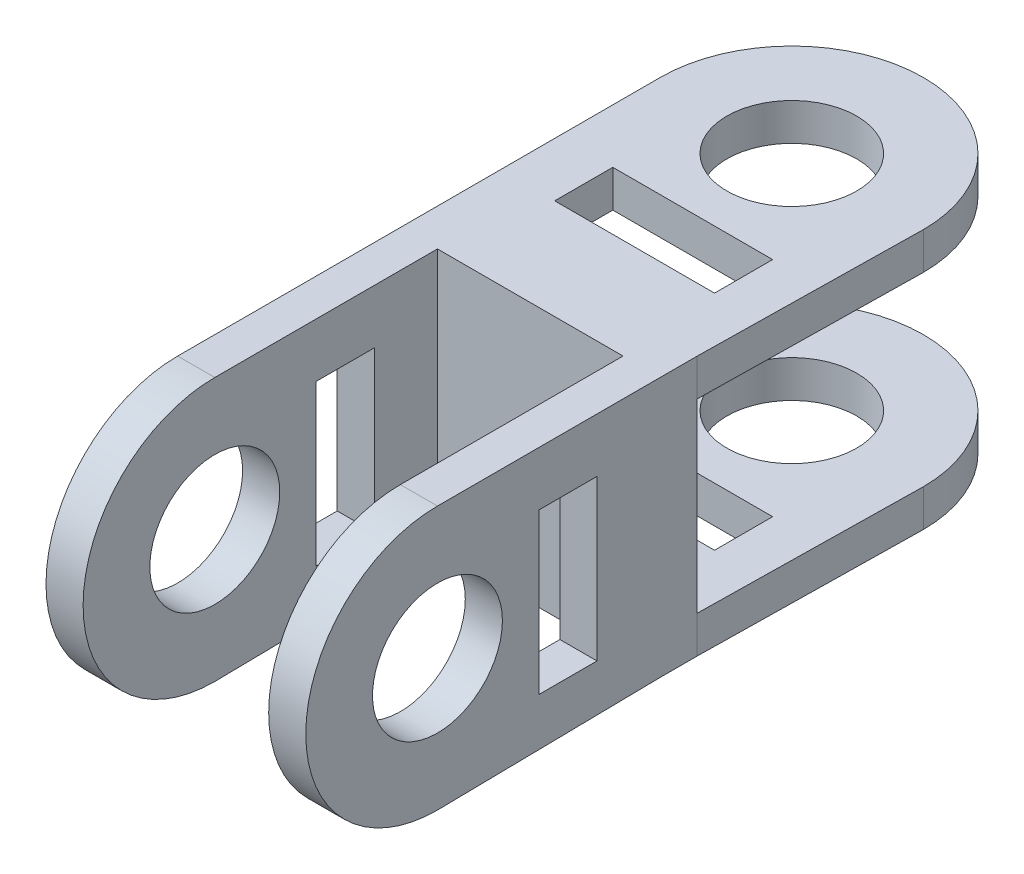
ISO-10303-21;
HEADER;
FILE_DESCRIPTION(('STEP AP214'),'2;1');
FILE_NAME('part.step','',(''),(''),'','','');
FILE_SCHEMA(('AUTOMOTIVE_DESIGN { 1 0 10303 214 1 1 1 1 }'));
ENDSEC;
DATA;
#1=APPLICATION_CONTEXT('core data for automotive mechanical design processes');
#2=APPLICATION_PROTOCOL_DEFINITION('international standard','automotive_design',2000,#1);
#3=PRODUCT_CONTEXT('',#1,'mechanical');
#4=PRODUCT('Part','Part','',(#3));
#5=PRODUCT_RELATED_PRODUCT_CATEGORY('part','',(#4));
#6=PRODUCT_DEFINITION_FORMATION('','',#4);
#7=PRODUCT_DEFINITION_CONTEXT('part definition',#1,'design');
#8=PRODUCT_DEFINITION('design','',#6,#7);
#9=PRODUCT_DEFINITION_SHAPE('','',#8);
#10=(LENGTH_UNIT() NAMED_UNIT(*) SI_UNIT(.MILLI.,.METRE.));
#11=(NAMED_UNIT(*) PLANE_ANGLE_UNIT() SI_UNIT($,.RADIAN.));
#12=(NAMED_UNIT(*) SI_UNIT($,.STERADIAN.) SOLID_ANGLE_UNIT());
#13=UNCERTAINTY_MEASURE_WITH_UNIT(LENGTH_MEASURE(1.E-05),#10,'distance_accuracy_value','');
#14=(GEOMETRIC_REPRESENTATION_CONTEXT(3) GLOBAL_UNCERTAINTY_ASSIGNED_CONTEXT((#13)) GLOBAL_UNIT_ASSIGNED_CONTEXT((#10,
#11,#12)) REPRESENTATION_CONTEXT('',''));
#15=CARTESIAN_POINT('',(0.,0.,0.));
#16=DIRECTION('',(0.,0.,1.));
#17=DIRECTION('',(1.,0.,0.));
#18=AXIS2_PLACEMENT_3D('',#15,#16,#17);
#19=CARTESIAN_POINT('',(-35.,35.,10.));
#20=DIRECTION('',(1.,0.,0.));
#21=DIRECTION('',(0.,1.,0.));
#22=AXIS2_PLACEMENT_3D('',#19,#20,#21);
#23=PLANE('',#22);
#24=DIRECTION('',(0.,-1.,0.));
#25=VECTOR('',#24,1.);
#26=CARTESIAN_POINT('',(-35.,20.4226359715063,42.6735252957079));
#27=LINE('',#26,#25);
#28=CARTESIAN_POINT('',(-35.,20.4226359715063,42.6735252957079));
#29=VERTEX_POINT('',#28);
#30=CARTESIAN_POINT('',(-35.,-22.6429275882208,42.6735252957079));
#31=VERTEX_POINT('',#30);
#32=EDGE_CURVE('E373',#29,#31,#27,.T.);
#33=ORIENTED_EDGE('',*,*,#32,.T.);
#34=DIRECTION('',(0.,0.,-1.));
#35=VECTOR('',#34,1.);
#36=CARTESIAN_POINT('',(-35.,-22.6429275882208,42.6735252957079));
#37=LINE('',#36,#35);
#38=CARTESIAN_POINT('',(-35.,-22.6429275882208,27.013320364898));
#39=VERTEX_POINT('',#38);
#40=EDGE_CURVE('E395',#31,#39,#37,.T.);
#41=ORIENTED_EDGE('',*,*,#40,.T.);
#42=DIRECTION('',(0.,1.,0.));
#43=VECTOR('',#42,1.);
#44=CARTESIAN_POINT('',(-35.,20.4226359715063,27.013320364898));
#45=LINE('',#44,#43);
#46=CARTESIAN_POINT('',(-35.,20.4226359715063,27.013320364898));
#47=VERTEX_POINT('',#46);
#48=EDGE_CURVE('E399',#39,#47,#45,.T.);
#49=ORIENTED_EDGE('',*,*,#48,.T.);
#50=DIRECTION('',(0.,0.,1.));
#51=VECTOR('',#50,1.);
#52=CARTESIAN_POINT('',(-35.,20.4226359715063,42.6735252957079));
#53=LINE('',#52,#51);
#54=EDGE_CURVE('E381',#47,#29,#53,.T.);
#55=ORIENTED_EDGE('',*,*,#54,.T.);
#56=EDGE_LOOP('',(#33,#41,#49,#55));
#57=FACE_BOUND('',#56,.T.);
#58=CARTESIAN_POINT('',(-35.,-0.47669536404981,70.));
#59=DIRECTION('',(1.,0.,0.));
#60=DIRECTION('',(0.,0.,-1.));
#61=AXIS2_PLACEMENT_3D('',#58,#59,#60);
#62=CIRCLE('',#61,17.5);
#63=CARTESIAN_POINT('',(-35.,-0.47669536404981,52.5));
#64=VERTEX_POINT('',#63);
#65=EDGE_CURVE('E425',#64,#64,#62,.T.);
#66=ORIENTED_EDGE('',*,*,#65,.T.);
#67=EDGE_LOOP('',(#66));
#68=FACE_BOUND('',#67,.T.);
#69=DIRECTION('',(0.,0.,-1.));
#70=VECTOR('',#69,1.);
#71=CARTESIAN_POINT('',(-35.,25.,0.));
#72=LINE('',#71,#70);
#73=CARTESIAN_POINT('',(-35.,25.,0.));
#74=VERTEX_POINT('',#73);
#75=CARTESIAN_POINT('',(-35.,25.,-60.));
#76=VERTEX_POINT('',#75);
#77=EDGE_CURVE('E503',#74,#76,#72,.T.);
#78=ORIENTED_EDGE('',*,*,#77,.F.);
#79=DIRECTION('',(0.,-1.,0.));
#80=VECTOR('',#79,1.);
#81=CARTESIAN_POINT('',(-35.,25.,0.));
#82=LINE('',#81,#80);
#83=CARTESIAN_POINT('',(-35.,-25.,0.));
#84=VERTEX_POINT('',#83);
#85=EDGE_CURVE('E513',#74,#84,#82,.T.);
#86=ORIENTED_EDGE('',*,*,#85,.T.);
#87=DIRECTION('',(0.,0.,-1.));
#88=VECTOR('',#87,1.);
#89=CARTESIAN_POINT('',(-35.,-25.,0.));
#90=LINE('',#89,#88);
#91=CARTESIAN_POINT('',(-35.,-25.,-60.));
#92=VERTEX_POINT('',#91);
#93=EDGE_CURVE('E505',#84,#92,#90,.T.);
#94=ORIENTED_EDGE('',*,*,#93,.T.);
#95=DIRECTION('',(0.,1.,0.));
#96=VECTOR('',#95,1.);
#97=CARTESIAN_POINT('',(-35.,-35.,-60.));
#98=LINE('',#97,#96);
#99=CARTESIAN_POINT('',(-35.,-35.,-60.));
#100=VERTEX_POINT('',#99);
#101=EDGE_CURVE('E298',#100,#92,#98,.T.);
#102=ORIENTED_EDGE('',*,*,#101,.F.);
#103=DIRECTION('',(0.,0.,-1.));
#104=VECTOR('',#103,1.);
#105=CARTESIAN_POINT('',(-35.,-35.,10.));
#106=LINE('',#105,#104);
#107=CARTESIAN_POINT('',(-35.,-35.,10.));
#108=VERTEX_POINT('',#107);
#109=EDGE_CURVE('E11',#108,#100,#106,.T.);
#110=ORIENTED_EDGE('',*,*,#109,.F.);
#111=DIRECTION('',(0.,0.0158878398569042,-0.999873780306635));
#112=VECTOR('',#111,1.);
#113=CARTESIAN_POINT('',(-35.,-35.9533907280996,70.));
#114=LINE('',#113,#112);
#115=CARTESIAN_POINT('',(-35.,-35.9533907280996,70.));
#116=VERTEX_POINT('',#115);
#117=EDGE_CURVE('E438',#116,#108,#114,.T.);
#118=ORIENTED_EDGE('',*,*,#117,.F.);
#119=CARTESIAN_POINT('',(-35.,-0.47669536404981,70.));
#120=DIRECTION('',(1.,0.,0.));
#121=DIRECTION('',(0.,0.,-1.));
#122=AXIS2_PLACEMENT_3D('',#119,#120,#121);
#123=CIRCLE('',#122,35.4766953640498);
#124=CARTESIAN_POINT('',(-35.,35.,70.));
#125=VERTEX_POINT('',#124);
#126=EDGE_CURVE('E430',#125,#116,#123,.T.);
#127=ORIENTED_EDGE('',*,*,#126,.F.);
#128=DIRECTION('',(0.,0.,-1.));
#129=VECTOR('',#128,1.);
#130=CARTESIAN_POINT('',(-35.,35.,10.));
#131=LINE('',#130,#129);
#132=CARTESIAN_POINT('',(-35.,35.,-60.));
#133=VERTEX_POINT('',#132);
#134=EDGE_CURVE('E463',#125,#133,#131,.T.);
#135=ORIENTED_EDGE('',*,*,#134,.T.);
#136=EDGE_CURVE('E297',#76,#133,#98,.T.);
#137=ORIENTED_EDGE('',*,*,#136,.F.);
#138=EDGE_LOOP('',(#78,#86,#94,#102,#110,#118,#127,#135,#137));
#139=FACE_BOUND('',#138,.T.);
#140=ADVANCED_FACE('F39',(#57,#68,#139),#23,.F.);
#141=CARTESIAN_POINT('',(0.47669536404981,-35.,-60.));
#142=DIRECTION('',(0.,1.,0.));
#143=DIRECTION('',(0.,0.,1.));
#144=AXIS2_PLACEMENT_3D('',#141,#142,#143);
#145=CYLINDRICAL_SURFACE('',#144,35.4766953640498);
#146=CARTESIAN_POINT('',(0.47669536404981,25.,-60.));
#147=DIRECTION('',(0.,-1.,0.));
#148=DIRECTION('',(0.,0.,-1.));
#149=AXIS2_PLACEMENT_3D('',#146,#147,#148);
#150=CIRCLE('',#149,35.4766953640498);
#151=CARTESIAN_POINT('',(35.9533907280996,25.,-60.));
#152=VERTEX_POINT('',#151);
#153=EDGE_CURVE('E600',#76,#152,#150,.T.);
#154=ORIENTED_EDGE('',*,*,#153,.F.);
#155=ORIENTED_EDGE('',*,*,#136,.T.);
#156=CARTESIAN_POINT('',(0.47669536404981,35.,-60.));
#157=DIRECTION('',(0.,-1.,0.));
#158=DIRECTION('',(0.,0.,-1.));
#159=AXIS2_PLACEMENT_3D('',#156,#157,#158);
#160=CIRCLE('',#159,35.4766953640498);
#161=CARTESIAN_POINT('',(35.9533907280996,35.,-60.));
#162=VERTEX_POINT('',#161);
#163=EDGE_CURVE('E274',#133,#162,#160,.T.);
#164=ORIENTED_EDGE('',*,*,#163,.T.);
#165=DIRECTION('',(0.,1.,0.));
#166=VECTOR('',#165,1.);
#167=CARTESIAN_POINT('',(35.9533907280996,-35.,-60.));
#168=LINE('',#167,#166);
#169=EDGE_CURVE('E286',#152,#162,#168,.T.);
#170=ORIENTED_EDGE('',*,*,#169,.F.);
#171=EDGE_LOOP('',(#154,#155,#164,#170));
#172=FACE_BOUND('',#171,.T.);
#173=ADVANCED_FACE('F581',(#172),#145,.T.);
#174=CARTESIAN_POINT('',(35.9533907280996,-35.,-60.));
#175=DIRECTION('',(-0.999873780306635,0.,-0.0158878398569042));
#176=DIRECTION('',(-0.0158878398569042,0.,0.999873780306635));
#177=AXIS2_PLACEMENT_3D('',#174,#175,#176);
#178=PLANE('',#177);
#179=DIRECTION('',(-0.0158878398569042,0.,0.999873780306635));
#180=VECTOR('',#179,1.);
#181=CARTESIAN_POINT('',(35.9533907280996,25.,-60.));
#182=LINE('',#181,#180);
#183=CARTESIAN_POINT('',(35.,25.,0.));
#184=VERTEX_POINT('',#183);
#185=EDGE_CURVE('E517',#152,#184,#182,.T.);
#186=ORIENTED_EDGE('',*,*,#185,.F.);
#187=ORIENTED_EDGE('',*,*,#169,.T.);
#188=DIRECTION('',(-0.0158878398569042,0.,0.999873780306635));
#189=VECTOR('',#188,1.);
#190=CARTESIAN_POINT('',(35.9533907280996,35.,-60.));
#191=LINE('',#190,#189);
#192=CARTESIAN_POINT('',(35.,35.,0.));
#193=VERTEX_POINT('',#192);
#194=EDGE_CURVE('E282',#162,#193,#191,.T.);
#195=ORIENTED_EDGE('',*,*,#194,.T.);
#196=DIRECTION('',(0.,1.,0.));
#197=VECTOR('',#196,1.);
#198=CARTESIAN_POINT('',(35.,35.,0.));
#199=LINE('',#198,#197);
#200=EDGE_CURVE('E458',#184,#193,#199,.T.);
#201=ORIENTED_EDGE('',*,*,#200,.F.);
#202=EDGE_LOOP('',(#186,#187,#195,#201));
#203=FACE_BOUND('',#202,.T.);
#204=ADVANCED_FACE('F586',(#203),#178,.F.);
#205=CARTESIAN_POINT('',(0.47669536404981,-35.,-60.));
#206=DIRECTION('',(0.,1.,0.));
#207=DIRECTION('',(0.,0.,1.));
#208=AXIS2_PLACEMENT_3D('',#205,#206,#207);
#209=CYLINDRICAL_SURFACE('',#208,17.5);
#210=CARTESIAN_POINT('',(0.47669536404981,35.,-60.));
#211=DIRECTION('',(0.,-1.,0.));
#212=DIRECTION('',(0.,0.,-1.));
#213=AXIS2_PLACEMENT_3D('',#210,#211,#212);
#214=CIRCLE('',#213,17.5);
#215=CARTESIAN_POINT('',(0.47669536404981,35.,-77.5));
#216=VERTEX_POINT('',#215);
#217=EDGE_CURVE('E264',#216,#216,#214,.T.);
#218=ORIENTED_EDGE('',*,*,#217,.F.);
#219=EDGE_LOOP('',(#218));
#220=FACE_BOUND('',#219,.T.);
#221=CARTESIAN_POINT('',(0.47669536404981,25.,-60.));
#222=DIRECTION('',(0.,-1.,0.));
#223=DIRECTION('',(0.,0.,-1.));
#224=AXIS2_PLACEMENT_3D('',#221,#222,#223);
#225=CIRCLE('',#224,17.5);
#226=CARTESIAN_POINT('',(0.47669536404981,25.,-77.5));
#227=VERTEX_POINT('',#226);
#228=EDGE_CURVE('E610',#227,#227,#225,.T.);
#229=ORIENTED_EDGE('',*,*,#228,.T.);
#230=EDGE_LOOP('',(#229));
#231=FACE_BOUND('',#230,.T.);
#232=ADVANCED_FACE('F646',(#220,#231),#209,.F.);
#233=CARTESIAN_POINT('',(-20.4226359715063,-35.,-32.6735252957079));
#234=DIRECTION('',(0.,0.,1.));
#235=DIRECTION('',(1.,0.,0.));
#236=AXIS2_PLACEMENT_3D('',#233,#234,#235);
#237=PLANE('',#236);
#238=DIRECTION('',(0.,1.,0.));
#239=VECTOR('',#238,1.);
#240=CARTESIAN_POINT('',(-20.4226359715063,-35.,-32.6735252957079));
#241=LINE('',#240,#239);
#242=CARTESIAN_POINT('',(-20.4226359715063,25.,-32.6735252957079));
#243=VERTEX_POINT('',#242);
#244=CARTESIAN_POINT('',(-20.4226359715063,35.,-32.6735252957079));
#245=VERTEX_POINT('',#244);
#246=EDGE_CURVE('E249',#243,#245,#241,.T.);
#247=ORIENTED_EDGE('',*,*,#246,.F.);
#248=DIRECTION('',(1.,0.,0.));
#249=VECTOR('',#248,1.);
#250=CARTESIAN_POINT('',(-20.4226359715063,25.,-32.6735252957079));
#251=LINE('',#250,#249);
#252=CARTESIAN_POINT('',(22.6429275882208,25.,-32.6735252957079));
#253=VERTEX_POINT('',#252);
#254=EDGE_CURVE('E62',#243,#253,#251,.T.);
#255=ORIENTED_EDGE('',*,*,#254,.T.);
#256=DIRECTION('',(0.,1.,0.));
#257=VECTOR('',#256,1.);
#258=CARTESIAN_POINT('',(22.6429275882208,-35.,-32.6735252957079));
#259=LINE('',#258,#257);
#260=CARTESIAN_POINT('',(22.6429275882208,35.,-32.6735252957079));
#261=VERTEX_POINT('',#260);
#262=EDGE_CURVE('E247',#253,#261,#259,.T.);
#263=ORIENTED_EDGE('',*,*,#262,.T.);
#264=DIRECTION('',(1.,0.,0.));
#265=VECTOR('',#264,1.);
#266=CARTESIAN_POINT('',(-20.4226359715063,35.,-32.6735252957079));
#267=LINE('',#266,#265);
#268=EDGE_CURVE('E512',#245,#261,#267,.T.);
#269=ORIENTED_EDGE('',*,*,#268,.F.);
#270=EDGE_LOOP('',(#247,#255,#263,#269));
#271=FACE_BOUND('',#270,.T.);
#272=ADVANCED_FACE('F245',(#271),#237,.T.);
#273=CARTESIAN_POINT('',(22.6429275882208,-35.,-32.6735252957079));
#274=DIRECTION('',(-1.,0.,0.));
#275=DIRECTION('',(0.,0.,1.));
#276=AXIS2_PLACEMENT_3D('',#273,#274,#275);
#277=PLANE('',#276);
#278=ORIENTED_EDGE('',*,*,#262,.F.);
#279=DIRECTION('',(0.,0.,1.));
#280=VECTOR('',#279,1.);
#281=CARTESIAN_POINT('',(22.6429275882208,25.,-32.6735252957079));
#282=LINE('',#281,#280);
#283=CARTESIAN_POINT('',(22.6429275882208,25.,-17.013320364898));
#284=VERTEX_POINT('',#283);
#285=EDGE_CURVE('E233',#253,#284,#282,.T.);
#286=ORIENTED_EDGE('',*,*,#285,.T.);
#287=DIRECTION('',(0.,1.,0.));
#288=VECTOR('',#287,1.);
#289=CARTESIAN_POINT('',(22.6429275882208,-35.,-17.013320364898));
#290=LINE('',#289,#288);
#291=CARTESIAN_POINT('',(22.6429275882208,35.,-17.013320364898));
#292=VERTEX_POINT('',#291);
#293=EDGE_CURVE('E266',#284,#292,#290,.T.);
#294=ORIENTED_EDGE('',*,*,#293,.T.);
#295=DIRECTION('',(0.,0.,1.));
#296=VECTOR('',#295,1.);
#297=CARTESIAN_POINT('',(22.6429275882208,35.,-32.6735252957079));
#298=LINE('',#297,#296);
#299=EDGE_CURVE('E255',#261,#292,#298,.T.);
#300=ORIENTED_EDGE('',*,*,#299,.F.);
#301=EDGE_LOOP('',(#278,#286,#294,#300));
#302=FACE_BOUND('',#301,.T.);
#303=ADVANCED_FACE('F253',(#302),#277,.T.);
#304=CARTESIAN_POINT('',(-20.4226359715063,-35.,-17.013320364898));
#305=DIRECTION('',(0.,0.,-1.));
#306=DIRECTION('',(-1.,0.,0.));
#307=AXIS2_PLACEMENT_3D('',#304,#305,#306);
#308=PLANE('',#307);
#309=ORIENTED_EDGE('',*,*,#293,.F.);
#310=DIRECTION('',(-1.,0.,0.));
#311=VECTOR('',#310,1.);
#312=CARTESIAN_POINT('',(-20.4226359715063,25.,-17.013320364898));
#313=LINE('',#312,#311);
#314=CARTESIAN_POINT('',(-20.4226359715063,25.,-17.013320364898));
#315=VERTEX_POINT('',#314);
#316=EDGE_CURVE('E237',#284,#315,#313,.T.);
#317=ORIENTED_EDGE('',*,*,#316,.T.);
#318=DIRECTION('',(0.,1.,0.));
#319=VECTOR('',#318,1.);
#320=CARTESIAN_POINT('',(-20.4226359715063,-35.,-17.013320364898));
#321=LINE('',#320,#319);
#322=CARTESIAN_POINT('',(-20.4226359715063,35.,-17.013320364898));
#323=VERTEX_POINT('',#322);
#324=EDGE_CURVE('E546',#315,#323,#321,.T.);
#325=ORIENTED_EDGE('',*,*,#324,.T.);
#326=DIRECTION('',(-1.,0.,0.));
#327=VECTOR('',#326,1.);
#328=CARTESIAN_POINT('',(-20.4226359715063,35.,-17.013320364898));
#329=LINE('',#328,#327);
#330=EDGE_CURVE('E536',#292,#323,#329,.T.);
#331=ORIENTED_EDGE('',*,*,#330,.F.);
#332=EDGE_LOOP('',(#309,#317,#325,#331));
#333=FACE_BOUND('',#332,.T.);
#334=ADVANCED_FACE('F558',(#333),#308,.T.);
#335=CARTESIAN_POINT('',(-20.4226359715063,-35.,-32.6735252957079));
#336=DIRECTION('',(1.,0.,0.));
#337=DIRECTION('',(0.,0.,-1.));
#338=AXIS2_PLACEMENT_3D('',#335,#336,#337);
#339=PLANE('',#338);
#340=ORIENTED_EDGE('',*,*,#324,.F.);
#341=DIRECTION('',(0.,0.,-1.));
#342=VECTOR('',#341,1.);
#343=CARTESIAN_POINT('',(-20.4226359715063,25.,-32.6735252957079));
#344=LINE('',#343,#342);
#345=EDGE_CURVE('E891',#315,#243,#344,.T.);
#346=ORIENTED_EDGE('',*,*,#345,.T.);
#347=ORIENTED_EDGE('',*,*,#246,.T.);
#348=DIRECTION('',(0.,0.,-1.));
#349=VECTOR('',#348,1.);
#350=CARTESIAN_POINT('',(-20.4226359715063,35.,-32.6735252957079));
#351=LINE('',#350,#349);
#352=EDGE_CURVE('E522',#323,#245,#351,.T.);
#353=ORIENTED_EDGE('',*,*,#352,.F.);
#354=EDGE_LOOP('',(#340,#346,#347,#353));
#355=FACE_BOUND('',#354,.T.);
#356=ADVANCED_FACE('F560',(#355),#339,.T.);
#357=CARTESIAN_POINT('',(-35.,35.,10.));
#358=DIRECTION('',(0.,-1.,0.));
#359=DIRECTION('',(0.,0.,-1.));
#360=AXIS2_PLACEMENT_3D('',#357,#358,#359);
#361=PLANE('',#360);
#362=DIRECTION('',(0.,0.,1.));
#363=VECTOR('',#362,1.);
#364=CARTESIAN_POINT('',(-25.,35.,10.));
#365=LINE('',#364,#363);
#366=CARTESIAN_POINT('',(-25.,35.,10.));
#367=VERTEX_POINT('',#366);
#368=CARTESIAN_POINT('',(-25.,35.,70.));
#369=VERTEX_POINT('',#368);
#370=EDGE_CURVE('E343',#367,#369,#365,.T.);
#371=ORIENTED_EDGE('',*,*,#370,.F.);
#372=DIRECTION('',(1.,0.,0.));
#373=VECTOR('',#372,1.);
#374=CARTESIAN_POINT('',(-25.,35.,10.));
#375=LINE('',#374,#373);
#376=CARTESIAN_POINT('',(25.,35.,10.));
#377=VERTEX_POINT('',#376);
#378=EDGE_CURVE('E354',#367,#377,#375,.T.);
#379=ORIENTED_EDGE('',*,*,#378,.T.);
#380=DIRECTION('',(0.,0.,1.));
#381=VECTOR('',#380,1.);
#382=CARTESIAN_POINT('',(25.,35.,10.));
#383=LINE('',#382,#381);
#384=CARTESIAN_POINT('',(25.,35.,70.));
#385=VERTEX_POINT('',#384);
#386=EDGE_CURVE('E358',#377,#385,#383,.T.);
#387=ORIENTED_EDGE('',*,*,#386,.T.);
#388=DIRECTION('',(-1.,0.,0.));
#389=VECTOR('',#388,1.);
#390=CARTESIAN_POINT('',(35.,35.,70.));
#391=LINE('',#390,#389);
#392=CARTESIAN_POINT('',(35.,35.,70.));
#393=VERTEX_POINT('',#392);
#394=EDGE_CURVE('E454',#393,#385,#391,.T.);
#395=ORIENTED_EDGE('',*,*,#394,.F.);
#396=DIRECTION('',(0.,0.,-1.));
#397=VECTOR('',#396,1.);
#398=CARTESIAN_POINT('',(35.,35.,10.));
#399=LINE('',#398,#397);
#400=EDGE_CURVE('E472',#393,#193,#399,.T.);
#401=ORIENTED_EDGE('',*,*,#400,.T.);
#402=ORIENTED_EDGE('',*,*,#194,.F.);
#403=ORIENTED_EDGE('',*,*,#163,.F.);
#404=ORIENTED_EDGE('',*,*,#134,.F.);
#405=EDGE_CURVE('E453',#369,#125,#391,.T.);
#406=ORIENTED_EDGE('',*,*,#405,.F.);
#407=EDGE_LOOP('',(#371,#379,#387,#395,#401,#402,#403,#404,#406));
#408=FACE_BOUND('',#407,.T.);
#409=ORIENTED_EDGE('',*,*,#217,.T.);
#410=EDGE_LOOP('',(#409));
#411=FACE_BOUND('',#410,.T.);
#412=ORIENTED_EDGE('',*,*,#268,.T.);
#413=ORIENTED_EDGE('',*,*,#299,.T.);
#414=ORIENTED_EDGE('',*,*,#330,.T.);
#415=ORIENTED_EDGE('',*,*,#352,.T.);
#416=EDGE_LOOP('',(#412,#413,#414,#415));
#417=FACE_BOUND('',#416,.T.);
#418=ADVANCED_FACE('F562',(#408,#411,#417),#361,.F.);
#419=CARTESIAN_POINT('',(35.,-0.47669536404981,70.));
#420=DIRECTION('',(-1.,0.,0.));
#421=DIRECTION('',(0.,0.,1.));
#422=AXIS2_PLACEMENT_3D('',#419,#420,#421);
#423=CYLINDRICAL_SURFACE('',#422,35.4766953640498);
#424=CARTESIAN_POINT('',(-25.,-0.47669536404981,70.));
#425=DIRECTION('',(1.,0.,0.));
#426=DIRECTION('',(0.,0.,-1.));
#427=AXIS2_PLACEMENT_3D('',#424,#425,#426);
#428=CIRCLE('',#427,35.4766953640498);
#429=CARTESIAN_POINT('',(-25.,-35.9533907280996,70.));
#430=VERTEX_POINT('',#429);
#431=EDGE_CURVE('E347',#369,#430,#428,.T.);
#432=ORIENTED_EDGE('',*,*,#431,.F.);
#433=ORIENTED_EDGE('',*,*,#405,.T.);
#434=ORIENTED_EDGE('',*,*,#126,.T.);
#435=DIRECTION('',(-1.,0.,0.));
#436=VECTOR('',#435,1.);
#437=CARTESIAN_POINT('',(35.,-35.9533907280996,70.));
#438=LINE('',#437,#436);
#439=EDGE_CURVE('E442',#430,#116,#438,.T.);
#440=ORIENTED_EDGE('',*,*,#439,.F.);
#441=EDGE_LOOP('',(#432,#433,#434,#440));
#442=FACE_BOUND('',#441,.T.);
#443=ADVANCED_FACE('F564',(#442),#423,.T.);
#444=CARTESIAN_POINT('',(35.,-35.9533907280996,70.));
#445=DIRECTION('',(0.,0.999873780306635,0.0158878398569042));
#446=DIRECTION('',(0.,-0.0158878398569042,0.999873780306635));
#447=AXIS2_PLACEMENT_3D('',#444,#445,#446);
#448=PLANE('',#447);
#449=DIRECTION('',(0.,0.0158878398569042,-0.999873780306635));
#450=VECTOR('',#449,1.);
#451=CARTESIAN_POINT('',(-25.,-35.9533907280996,70.));
#452=LINE('',#451,#450);
#453=CARTESIAN_POINT('',(-25.,-35.,10.));
#454=VERTEX_POINT('',#453);
#455=EDGE_CURVE('E350',#430,#454,#452,.T.);
#456=ORIENTED_EDGE('',*,*,#455,.F.);
#457=ORIENTED_EDGE('',*,*,#439,.T.);
#458=ORIENTED_EDGE('',*,*,#117,.T.);
#459=DIRECTION('',(1.,0.,0.));
#460=VECTOR('',#459,1.);
#461=CARTESIAN_POINT('',(-35.,-35.,10.));
#462=LINE('',#461,#460);
#463=EDGE_CURVE('E459',#108,#454,#462,.T.);
#464=ORIENTED_EDGE('',*,*,#463,.T.);
#465=EDGE_LOOP('',(#456,#457,#458,#464));
#466=FACE_BOUND('',#465,.T.);
#467=ADVANCED_FACE('F571',(#466),#448,.F.);
#468=CARTESIAN_POINT('',(35.,-0.47669536404981,70.));
#469=DIRECTION('',(-1.,0.,0.));
#470=DIRECTION('',(0.,0.,1.));
#471=AXIS2_PLACEMENT_3D('',#468,#469,#470);
#472=CYLINDRICAL_SURFACE('',#471,17.5);
#473=ORIENTED_EDGE('',*,*,#65,.F.);
#474=EDGE_LOOP('',(#473));
#475=FACE_BOUND('',#474,.T.);
#476=CARTESIAN_POINT('',(-25.,-0.47669536404981,70.));
#477=DIRECTION('',(1.,0.,0.));
#478=DIRECTION('',(0.,0.,-1.));
#479=AXIS2_PLACEMENT_3D('',#476,#477,#478);
#480=CIRCLE('',#479,17.5);
#481=CARTESIAN_POINT('',(-25.,-0.47669536404981,52.5));
#482=VERTEX_POINT('',#481);
#483=EDGE_CURVE('E331',#482,#482,#480,.T.);
#484=ORIENTED_EDGE('',*,*,#483,.T.);
#485=EDGE_LOOP('',(#484));
#486=FACE_BOUND('',#485,.T.);
#487=ADVANCED_FACE('F687',(#475,#486),#472,.F.);
#488=CARTESIAN_POINT('',(35.,20.4226359715063,42.6735252957079));
#489=DIRECTION('',(0.,0.,-1.));
#490=DIRECTION('',(-1.,0.,0.));
#491=AXIS2_PLACEMENT_3D('',#488,#489,#490);
#492=PLANE('',#491);
#493=DIRECTION('',(-1.,0.,0.));
#494=VECTOR('',#493,1.);
#495=CARTESIAN_POINT('',(35.,20.4226359715063,42.6735252957079));
#496=LINE('',#495,#494);
#497=CARTESIAN_POINT('',(-25.,20.4226359715063,42.6735252957079));
#498=VERTEX_POINT('',#497);
#499=EDGE_CURVE('E391',#498,#29,#496,.T.);
#500=ORIENTED_EDGE('',*,*,#499,.F.);
#501=DIRECTION('',(0.,-1.,0.));
#502=VECTOR('',#501,1.);
#503=CARTESIAN_POINT('',(-25.,20.4226359715063,42.6735252957079));
#504=LINE('',#503,#502);
#505=CARTESIAN_POINT('',(-25.,-22.6429275882208,42.6735252957079));
#506=VERTEX_POINT('',#505);
#507=EDGE_CURVE('E303',#498,#506,#504,.T.);
#508=ORIENTED_EDGE('',*,*,#507,.T.);
#509=DIRECTION('',(-1.,0.,0.));
#510=VECTOR('',#509,1.);
#511=CARTESIAN_POINT('',(35.,-22.6429275882208,42.6735252957079));
#512=LINE('',#511,#510);
#513=EDGE_CURVE('E420',#506,#31,#512,.T.);
#514=ORIENTED_EDGE('',*,*,#513,.T.);
#515=ORIENTED_EDGE('',*,*,#32,.F.);
#516=EDGE_LOOP('',(#500,#508,#514,#515));
#517=FACE_BOUND('',#516,.T.);
#518=ADVANCED_FACE('F682',(#517),#492,.T.);
#519=CARTESIAN_POINT('',(35.,-22.6429275882208,42.6735252957079));
#520=DIRECTION('',(0.,1.,0.));
#521=DIRECTION('',(0.,0.,1.));
#522=AXIS2_PLACEMENT_3D('',#519,#520,#521);
#523=PLANE('',#522);
#524=ORIENTED_EDGE('',*,*,#513,.F.);
#525=DIRECTION('',(0.,0.,-1.));
#526=VECTOR('',#525,1.);
#527=CARTESIAN_POINT('',(-25.,-22.6429275882208,42.6735252957079));
#528=LINE('',#527,#526);
#529=CARTESIAN_POINT('',(-25.,-22.6429275882208,27.013320364898));
#530=VERTEX_POINT('',#529);
#531=EDGE_CURVE('E307',#506,#530,#528,.T.);
#532=ORIENTED_EDGE('',*,*,#531,.T.);
#533=DIRECTION('',(-1.,0.,0.));
#534=VECTOR('',#533,1.);
#535=CARTESIAN_POINT('',(35.,-22.6429275882208,27.013320364898));
#536=LINE('',#535,#534);
#537=EDGE_CURVE('E415',#530,#39,#536,.T.);
#538=ORIENTED_EDGE('',*,*,#537,.T.);
#539=ORIENTED_EDGE('',*,*,#40,.F.);
#540=EDGE_LOOP('',(#524,#532,#538,#539));
#541=FACE_BOUND('',#540,.T.);
#542=ADVANCED_FACE('F677',(#541),#523,.T.);
#543=CARTESIAN_POINT('',(35.,20.4226359715063,27.013320364898));
#544=DIRECTION('',(0.,0.,1.));
#545=DIRECTION('',(1.,0.,0.));
#546=AXIS2_PLACEMENT_3D('',#543,#544,#545);
#547=PLANE('',#546);
#548=ORIENTED_EDGE('',*,*,#537,.F.);
#549=DIRECTION('',(0.,1.,0.));
#550=VECTOR('',#549,1.);
#551=CARTESIAN_POINT('',(-25.,20.4226359715063,27.013320364898));
#552=LINE('',#551,#550);
#553=CARTESIAN_POINT('',(-25.,20.4226359715063,27.013320364898));
#554=VERTEX_POINT('',#553);
#555=EDGE_CURVE('E312',#530,#554,#552,.T.);
#556=ORIENTED_EDGE('',*,*,#555,.T.);
#557=DIRECTION('',(-1.,0.,0.));
#558=VECTOR('',#557,1.);
#559=CARTESIAN_POINT('',(35.,20.4226359715063,27.013320364898));
#560=LINE('',#559,#558);
#561=EDGE_CURVE('E410',#554,#47,#560,.T.);
#562=ORIENTED_EDGE('',*,*,#561,.T.);
#563=ORIENTED_EDGE('',*,*,#48,.F.);
#564=EDGE_LOOP('',(#548,#556,#562,#563));
#565=FACE_BOUND('',#564,.T.);
#566=ADVANCED_FACE('F672',(#565),#547,.T.);
#567=CARTESIAN_POINT('',(35.,20.4226359715063,42.6735252957079));
#568=DIRECTION('',(0.,-1.,0.));
#569=DIRECTION('',(0.,0.,-1.));
#570=AXIS2_PLACEMENT_3D('',#567,#568,#569);
#571=PLANE('',#570);
#572=ORIENTED_EDGE('',*,*,#561,.F.);
#573=DIRECTION('',(0.,0.,1.));
#574=VECTOR('',#573,1.);
#575=CARTESIAN_POINT('',(-25.,20.4226359715063,42.6735252957079));
#576=LINE('',#575,#574);
#577=EDGE_CURVE('E316',#554,#498,#576,.T.);
#578=ORIENTED_EDGE('',*,*,#577,.T.);
#579=ORIENTED_EDGE('',*,*,#499,.T.);
#580=ORIENTED_EDGE('',*,*,#54,.F.);
#581=EDGE_LOOP('',(#572,#578,#579,#580));
#582=FACE_BOUND('',#581,.T.);
#583=ADVANCED_FACE('F667',(#582),#571,.T.);
#584=CARTESIAN_POINT('',(-35.,-35.,10.));
#585=DIRECTION('',(0.,1.,0.));
#586=DIRECTION('',(-1.,0.,0.));
#587=AXIS2_PLACEMENT_3D('',#584,#585,#586);
#588=PLANE('',#587);
#589=ORIENTED_EDGE('',*,*,#109,.T.);
#590=CARTESIAN_POINT('',(0.47669536404981,-35.,-60.));
#591=DIRECTION('',(0.,-1.,0.));
#592=DIRECTION('',(0.,0.,-1.));
#593=AXIS2_PLACEMENT_3D('',#590,#591,#592);
#594=CIRCLE('',#593,35.4766953640498);
#595=CARTESIAN_POINT('',(35.9533907280996,-35.,-60.));
#596=VERTEX_POINT('',#595);
#597=EDGE_CURVE('E278',#100,#596,#594,.T.);
#598=ORIENTED_EDGE('',*,*,#597,.T.);
#599=DIRECTION('',(-0.0158878398569042,0.,0.999873780306635));
#600=VECTOR('',#599,1.);
#601=CARTESIAN_POINT('',(35.9533907280996,-35.,-60.));
#602=LINE('',#601,#600);
#603=CARTESIAN_POINT('',(35.,-35.,0.));
#604=VERTEX_POINT('',#603);
#605=EDGE_CURVE('E281',#596,#604,#602,.T.);
#606=ORIENTED_EDGE('',*,*,#605,.T.);
#607=DIRECTION('',(0.,0.,-1.));
#608=VECTOR('',#607,1.);
#609=CARTESIAN_POINT('',(35.,-35.,10.));
#610=LINE('',#609,#608);
#611=CARTESIAN_POINT('',(35.,-35.,10.));
#612=VERTEX_POINT('',#611);
#613=EDGE_CURVE('E47',#612,#604,#610,.T.);
#614=ORIENTED_EDGE('',*,*,#613,.F.);
#615=CARTESIAN_POINT('',(25.,-35.,10.));
#616=VERTEX_POINT('',#615);
#617=EDGE_CURVE('E464',#616,#612,#462,.T.);
#618=ORIENTED_EDGE('',*,*,#617,.F.);
#619=DIRECTION('',(1.,0.,0.));
#620=VECTOR('',#619,1.);
#621=CARTESIAN_POINT('',(-25.,-35.,10.));
#622=LINE('',#621,#620);
#623=EDGE_CURVE('E369',#454,#616,#622,.T.);
#624=ORIENTED_EDGE('',*,*,#623,.F.);
#625=ORIENTED_EDGE('',*,*,#463,.F.);
#626=EDGE_LOOP('',(#589,#598,#606,#614,#618,#624,#625));
#627=FACE_BOUND('',#626,.T.);
#628=CARTESIAN_POINT('',(0.47669536404981,-35.,-60.));
#629=DIRECTION('',(0.,-1.,0.));
#630=DIRECTION('',(0.,0.,-1.));
#631=AXIS2_PLACEMENT_3D('',#628,#629,#630);
#632=CIRCLE('',#631,17.5);
#633=CARTESIAN_POINT('',(0.47669536404981,-35.,-77.5));
#634=VERTEX_POINT('',#633);
#635=EDGE_CURVE('E270',#634,#634,#632,.T.);
#636=ORIENTED_EDGE('',*,*,#635,.F.);
#637=EDGE_LOOP('',(#636));
#638=FACE_BOUND('',#637,.T.);
#639=DIRECTION('',(0.,0.,1.));
#640=VECTOR('',#639,1.);
#641=CARTESIAN_POINT('',(22.6429275882208,-35.,-32.6735252957079));
#642=LINE('',#641,#640);
#643=CARTESIAN_POINT('',(22.6429275882208,-35.,-32.6735252957079));
#644=VERTEX_POINT('',#643);
#645=CARTESIAN_POINT('',(22.6429275882208,-35.,-17.013320364898));
#646=VERTEX_POINT('',#645);
#647=EDGE_CURVE('E521',#644,#646,#642,.T.);
#648=ORIENTED_EDGE('',*,*,#647,.F.);
#649=DIRECTION('',(1.,0.,0.));
#650=VECTOR('',#649,1.);
#651=CARTESIAN_POINT('',(-20.4226359715063,-35.,-32.6735252957079));
#652=LINE('',#651,#650);
#653=CARTESIAN_POINT('',(-20.4226359715063,-35.,-32.6735252957079));
#654=VERTEX_POINT('',#653);
#655=EDGE_CURVE('E518',#654,#644,#652,.T.);
#656=ORIENTED_EDGE('',*,*,#655,.F.);
#657=DIRECTION('',(0.,0.,-1.));
#658=VECTOR('',#657,1.);
#659=CARTESIAN_POINT('',(-20.4226359715063,-35.,-32.6735252957079));
#660=LINE('',#659,#658);
#661=CARTESIAN_POINT('',(-20.4226359715063,-35.,-17.013320364898));
#662=VERTEX_POINT('',#661);
#663=EDGE_CURVE('E529',#662,#654,#660,.T.);
#664=ORIENTED_EDGE('',*,*,#663,.F.);
#665=DIRECTION('',(-1.,0.,0.));
#666=VECTOR('',#665,1.);
#667=CARTESIAN_POINT('',(-20.4226359715063,-35.,-17.013320364898));
#668=LINE('',#667,#666);
#669=EDGE_CURVE('E525',#646,#662,#668,.T.);
#670=ORIENTED_EDGE('',*,*,#669,.F.);
#671=EDGE_LOOP('',(#648,#656,#664,#670));
#672=FACE_BOUND('',#671,.T.);
#673=ADVANCED_FACE('F485',(#627,#638,#672),#588,.F.);
#674=CARTESIAN_POINT('',(35.,35.,10.));
#675=DIRECTION('',(-1.,0.,0.));
#676=DIRECTION('',(0.,-1.,0.));
#677=AXIS2_PLACEMENT_3D('',#674,#675,#676);
#678=PLANE('',#677);
#679=CARTESIAN_POINT('',(35.,-25.,0.));
#680=VERTEX_POINT('',#679);
#681=EDGE_CURVE('E465',#604,#680,#199,.T.);
#682=ORIENTED_EDGE('',*,*,#681,.T.);
#683=DIRECTION('',(0.,-1.,0.));
#684=VECTOR('',#683,1.);
#685=CARTESIAN_POINT('',(35.,25.,0.));
#686=LINE('',#685,#684);
#687=EDGE_CURVE('E509',#184,#680,#686,.T.);
#688=ORIENTED_EDGE('',*,*,#687,.F.);
#689=ORIENTED_EDGE('',*,*,#200,.T.);
#690=ORIENTED_EDGE('',*,*,#400,.F.);
#691=CARTESIAN_POINT('',(35.,-0.47669536404981,70.));
#692=DIRECTION('',(1.,0.,0.));
#693=DIRECTION('',(0.,0.,-1.));
#694=AXIS2_PLACEMENT_3D('',#691,#692,#693);
#695=CIRCLE('',#694,35.4766953640498);
#696=CARTESIAN_POINT('',(35.,-35.9533907280996,70.));
#697=VERTEX_POINT('',#696);
#698=EDGE_CURVE('E434',#393,#697,#695,.T.);
#699=ORIENTED_EDGE('',*,*,#698,.T.);
#700=DIRECTION('',(0.,0.0158878398569042,-0.999873780306635));
#701=VECTOR('',#700,1.);
#702=CARTESIAN_POINT('',(35.,-35.9533907280996,70.));
#703=LINE('',#702,#701);
#704=EDGE_CURVE('E437',#697,#612,#703,.T.);
#705=ORIENTED_EDGE('',*,*,#704,.T.);
#706=ORIENTED_EDGE('',*,*,#613,.T.);
#707=EDGE_LOOP('',(#682,#688,#689,#690,#699,#705,#706));
#708=FACE_BOUND('',#707,.T.);
#709=CARTESIAN_POINT('',(35.,-0.47669536404981,70.));
#710=DIRECTION('',(1.,0.,0.));
#711=DIRECTION('',(0.,0.,-1.));
#712=AXIS2_PLACEMENT_3D('',#709,#710,#711);
#713=CIRCLE('',#712,17.5);
#714=CARTESIAN_POINT('',(35.,-0.47669536404981,52.5));
#715=VERTEX_POINT('',#714);
#716=EDGE_CURVE('E426',#715,#715,#713,.T.);
#717=ORIENTED_EDGE('',*,*,#716,.F.);
#718=EDGE_LOOP('',(#717));
#719=FACE_BOUND('',#718,.T.);
#720=DIRECTION('',(0.,0.,-1.));
#721=VECTOR('',#720,1.);
#722=CARTESIAN_POINT('',(35.,-22.6429275882208,42.6735252957079));
#723=LINE('',#722,#721);
#724=CARTESIAN_POINT('',(35.,-22.6429275882208,42.6735252957079));
#725=VERTEX_POINT('',#724);
#726=CARTESIAN_POINT('',(35.,-22.6429275882208,27.013320364898));
#727=VERTEX_POINT('',#726);
#728=EDGE_CURVE('E380',#725,#727,#723,.T.);
#729=ORIENTED_EDGE('',*,*,#728,.F.);
#730=DIRECTION('',(0.,-1.,0.));
#731=VECTOR('',#730,1.);
#732=CARTESIAN_POINT('',(35.,20.4226359715063,42.6735252957079));
#733=LINE('',#732,#731);
#734=CARTESIAN_POINT('',(35.,20.4226359715063,42.6735252957079));
#735=VERTEX_POINT('',#734);
#736=EDGE_CURVE('E377',#735,#725,#733,.T.);
#737=ORIENTED_EDGE('',*,*,#736,.F.);
#738=DIRECTION('',(0.,0.,1.));
#739=VECTOR('',#738,1.);
#740=CARTESIAN_POINT('',(35.,20.4226359715063,42.6735252957079));
#741=LINE('',#740,#739);
#742=CARTESIAN_POINT('',(35.,20.4226359715063,27.013320364898));
#743=VERTEX_POINT('',#742);
#744=EDGE_CURVE('E388',#743,#735,#741,.T.);
#745=ORIENTED_EDGE('',*,*,#744,.F.);
#746=DIRECTION('',(0.,1.,0.));
#747=VECTOR('',#746,1.);
#748=CARTESIAN_POINT('',(35.,20.4226359715063,27.013320364898));
#749=LINE('',#748,#747);
#750=EDGE_CURVE('E384',#727,#743,#749,.T.);
#751=ORIENTED_EDGE('',*,*,#750,.F.);
#752=EDGE_LOOP('',(#729,#737,#745,#751));
#753=FACE_BOUND('',#752,.T.);
#754=ADVANCED_FACE('F479',(#708,#719,#753),#678,.F.);
#755=ORIENTED_EDGE('',*,*,#394,.T.);
#756=CARTESIAN_POINT('',(25.,-0.47669536404981,70.));
#757=DIRECTION('',(1.,0.,0.));
#758=DIRECTION('',(0.,0.,-1.));
#759=AXIS2_PLACEMENT_3D('',#756,#757,#758);
#760=CIRCLE('',#759,35.4766953640498);
#761=CARTESIAN_POINT('',(25.,-35.9533907280996,70.));
#762=VERTEX_POINT('',#761);
#763=EDGE_CURVE('E362',#385,#762,#760,.T.);
#764=ORIENTED_EDGE('',*,*,#763,.T.);
#765=EDGE_CURVE('E449',#697,#762,#438,.T.);
#766=ORIENTED_EDGE('',*,*,#765,.F.);
#767=ORIENTED_EDGE('',*,*,#698,.F.);
#768=EDGE_LOOP('',(#755,#764,#766,#767));
#769=FACE_BOUND('',#768,.T.);
#770=ADVANCED_FACE('F574',(#769),#423,.T.);
#771=ORIENTED_EDGE('',*,*,#765,.T.);
#772=DIRECTION('',(0.,0.0158878398569042,-0.999873780306635));
#773=VECTOR('',#772,1.);
#774=CARTESIAN_POINT('',(25.,-35.9533907280996,70.));
#775=LINE('',#774,#773);
#776=EDGE_CURVE('E344',#762,#616,#775,.T.);
#777=ORIENTED_EDGE('',*,*,#776,.T.);
#778=ORIENTED_EDGE('',*,*,#617,.T.);
#779=ORIENTED_EDGE('',*,*,#704,.F.);
#780=EDGE_LOOP('',(#771,#777,#778,#779));
#781=FACE_BOUND('',#780,.T.);
#782=ADVANCED_FACE('F685',(#781),#448,.F.);
#783=CARTESIAN_POINT('',(25.,-0.47669536404981,70.));
#784=DIRECTION('',(1.,0.,0.));
#785=DIRECTION('',(0.,0.,-1.));
#786=AXIS2_PLACEMENT_3D('',#783,#784,#785);
#787=CIRCLE('',#786,17.5);
#788=CARTESIAN_POINT('',(25.,-0.47669536404981,52.5));
#789=VERTEX_POINT('',#788);
#790=EDGE_CURVE('E320',#789,#789,#787,.T.);
#791=ORIENTED_EDGE('',*,*,#790,.F.);
#792=EDGE_LOOP('',(#791));
#793=FACE_BOUND('',#792,.T.);
#794=ORIENTED_EDGE('',*,*,#716,.T.);
#795=EDGE_LOOP('',(#794));
#796=FACE_BOUND('',#795,.T.);
#797=ADVANCED_FACE('F680',(#793,#796),#472,.F.);
#798=DIRECTION('',(0.,-1.,0.));
#799=VECTOR('',#798,1.);
#800=CARTESIAN_POINT('',(25.,20.4226359715063,42.6735252957079));
#801=LINE('',#800,#799);
#802=CARTESIAN_POINT('',(25.,20.4226359715063,42.6735252957079));
#803=VERTEX_POINT('',#802);
#804=CARTESIAN_POINT('',(25.,-22.6429275882208,42.6735252957079));
#805=VERTEX_POINT('',#804);
#806=EDGE_CURVE('E302',#803,#805,#801,.T.);
#807=ORIENTED_EDGE('',*,*,#806,.F.);
#808=EDGE_CURVE('E406',#735,#803,#496,.T.);
#809=ORIENTED_EDGE('',*,*,#808,.F.);
#810=ORIENTED_EDGE('',*,*,#736,.T.);
#811=EDGE_CURVE('E421',#725,#805,#512,.T.);
#812=ORIENTED_EDGE('',*,*,#811,.T.);
#813=EDGE_LOOP('',(#807,#809,#810,#812));
#814=FACE_BOUND('',#813,.T.);
#815=ADVANCED_FACE('F675',(#814),#492,.T.);
#816=DIRECTION('',(0.,0.,-1.));
#817=VECTOR('',#816,1.);
#818=CARTESIAN_POINT('',(25.,-22.6429275882208,42.6735252957079));
#819=LINE('',#818,#817);
#820=CARTESIAN_POINT('',(25.,-22.6429275882208,27.013320364898));
#821=VERTEX_POINT('',#820);
#822=EDGE_CURVE('E323',#805,#821,#819,.T.);
#823=ORIENTED_EDGE('',*,*,#822,.F.);
#824=ORIENTED_EDGE('',*,*,#811,.F.);
#825=ORIENTED_EDGE('',*,*,#728,.T.);
#826=EDGE_CURVE('E416',#727,#821,#536,.T.);
#827=ORIENTED_EDGE('',*,*,#826,.T.);
#828=EDGE_LOOP('',(#823,#824,#825,#827));
#829=FACE_BOUND('',#828,.T.);
#830=ADVANCED_FACE('F670',(#829),#523,.T.);
#831=DIRECTION('',(0.,1.,0.));
#832=VECTOR('',#831,1.);
#833=CARTESIAN_POINT('',(25.,20.4226359715063,27.013320364898));
#834=LINE('',#833,#832);
#835=CARTESIAN_POINT('',(25.,20.4226359715063,27.013320364898));
#836=VERTEX_POINT('',#835);
#837=EDGE_CURVE('E326',#821,#836,#834,.T.);
#838=ORIENTED_EDGE('',*,*,#837,.F.);
#839=ORIENTED_EDGE('',*,*,#826,.F.);
#840=ORIENTED_EDGE('',*,*,#750,.T.);
#841=EDGE_CURVE('E411',#743,#836,#560,.T.);
#842=ORIENTED_EDGE('',*,*,#841,.T.);
#843=EDGE_LOOP('',(#838,#839,#840,#842));
#844=FACE_BOUND('',#843,.T.);
#845=ADVANCED_FACE('F665',(#844),#547,.T.);
#846=DIRECTION('',(0.,0.,1.));
#847=VECTOR('',#846,1.);
#848=CARTESIAN_POINT('',(25.,20.4226359715063,42.6735252957079));
#849=LINE('',#848,#847);
#850=EDGE_CURVE('E308',#836,#803,#849,.T.);
#851=ORIENTED_EDGE('',*,*,#850,.F.);
#852=ORIENTED_EDGE('',*,*,#841,.F.);
#853=ORIENTED_EDGE('',*,*,#744,.T.);
#854=ORIENTED_EDGE('',*,*,#808,.T.);
#855=EDGE_LOOP('',(#851,#852,#853,#854));
#856=FACE_BOUND('',#855,.T.);
#857=ADVANCED_FACE('F661',(#856),#571,.T.);
#858=CARTESIAN_POINT('',(-25.,-35.,10.));
#859=DIRECTION('',(0.,0.,-1.));
#860=DIRECTION('',(-1.,0.,0.));
#861=AXIS2_PLACEMENT_3D('',#858,#859,#860);
#862=PLANE('',#861);
#863=DIRECTION('',(0.,1.,0.));
#864=VECTOR('',#863,1.);
#865=CARTESIAN_POINT('',(25.,-35.,10.));
#866=LINE('',#865,#864);
#867=EDGE_CURVE('E335',#616,#377,#866,.T.);
#868=ORIENTED_EDGE('',*,*,#867,.T.);
#869=ORIENTED_EDGE('',*,*,#378,.F.);
#870=DIRECTION('',(0.,1.,0.));
#871=VECTOR('',#870,1.);
#872=CARTESIAN_POINT('',(-25.,-35.,10.));
#873=LINE('',#872,#871);
#874=EDGE_CURVE('E339',#454,#367,#873,.T.);
#875=ORIENTED_EDGE('',*,*,#874,.F.);
#876=ORIENTED_EDGE('',*,*,#623,.T.);
#877=EDGE_LOOP('',(#868,#869,#875,#876));
#878=FACE_BOUND('',#877,.T.);
#879=ADVANCED_FACE('F654',(#878),#862,.F.);
#880=CARTESIAN_POINT('',(-25.,-0.47669536404981,70.));
#881=DIRECTION('',(1.,0.,0.));
#882=DIRECTION('',(0.,0.,-1.));
#883=AXIS2_PLACEMENT_3D('',#880,#881,#882);
#884=PLANE('',#883);
#885=ORIENTED_EDGE('',*,*,#577,.F.);
#886=ORIENTED_EDGE('',*,*,#555,.F.);
#887=ORIENTED_EDGE('',*,*,#531,.F.);
#888=ORIENTED_EDGE('',*,*,#507,.F.);
#889=EDGE_LOOP('',(#885,#886,#887,#888));
#890=FACE_BOUND('',#889,.T.);
#891=ORIENTED_EDGE('',*,*,#483,.F.);
#892=EDGE_LOOP('',(#891));
#893=FACE_BOUND('',#892,.T.);
#894=ORIENTED_EDGE('',*,*,#874,.T.);
#895=ORIENTED_EDGE('',*,*,#370,.T.);
#896=ORIENTED_EDGE('',*,*,#431,.T.);
#897=ORIENTED_EDGE('',*,*,#455,.T.);
#898=EDGE_LOOP('',(#894,#895,#896,#897));
#899=FACE_BOUND('',#898,.T.);
#900=ADVANCED_FACE('F651',(#890,#893,#899),#884,.T.);
#901=CARTESIAN_POINT('',(25.,-0.47669536404981,70.));
#902=DIRECTION('',(1.,0.,0.));
#903=DIRECTION('',(0.,0.,-1.));
#904=AXIS2_PLACEMENT_3D('',#901,#902,#903);
#905=PLANE('',#904);
#906=ORIENTED_EDGE('',*,*,#806,.T.);
#907=ORIENTED_EDGE('',*,*,#822,.T.);
#908=ORIENTED_EDGE('',*,*,#837,.T.);
#909=ORIENTED_EDGE('',*,*,#850,.T.);
#910=EDGE_LOOP('',(#906,#907,#908,#909));
#911=FACE_BOUND('',#910,.T.);
#912=ORIENTED_EDGE('',*,*,#790,.T.);
#913=EDGE_LOOP('',(#912));
#914=FACE_BOUND('',#913,.T.);
#915=ORIENTED_EDGE('',*,*,#867,.F.);
#916=ORIENTED_EDGE('',*,*,#776,.F.);
#917=ORIENTED_EDGE('',*,*,#763,.F.);
#918=ORIENTED_EDGE('',*,*,#386,.F.);
#919=EDGE_LOOP('',(#915,#916,#917,#918));
#920=FACE_BOUND('',#919,.T.);
#921=ADVANCED_FACE('F650',(#911,#914,#920),#905,.F.);
#922=ORIENTED_EDGE('',*,*,#101,.T.);
#923=CARTESIAN_POINT('',(0.47669536404981,-25.,-60.));
#924=DIRECTION('',(0.,-1.,0.));
#925=DIRECTION('',(0.,0.,-1.));
#926=AXIS2_PLACEMENT_3D('',#923,#924,#925);
#927=CIRCLE('',#926,35.4766953640498);
#928=CARTESIAN_POINT('',(35.9533907280996,-25.,-60.));
#929=VERTEX_POINT('',#928);
#930=EDGE_CURVE('E498',#92,#929,#927,.T.);
#931=ORIENTED_EDGE('',*,*,#930,.T.);
#932=EDGE_CURVE('E293',#596,#929,#168,.T.);
#933=ORIENTED_EDGE('',*,*,#932,.F.);
#934=ORIENTED_EDGE('',*,*,#597,.F.);
#935=EDGE_LOOP('',(#922,#931,#933,#934));
#936=FACE_BOUND('',#935,.T.);
#937=ADVANCED_FACE('F589',(#936),#145,.T.);
#938=ORIENTED_EDGE('',*,*,#932,.T.);
#939=DIRECTION('',(-0.0158878398569042,0.,0.999873780306635));
#940=VECTOR('',#939,1.);
#941=CARTESIAN_POINT('',(35.9533907280996,-25.,-60.));
#942=LINE('',#941,#940);
#943=EDGE_CURVE('E494',#929,#680,#942,.T.);
#944=ORIENTED_EDGE('',*,*,#943,.T.);
#945=ORIENTED_EDGE('',*,*,#681,.F.);
#946=ORIENTED_EDGE('',*,*,#605,.F.);
#947=EDGE_LOOP('',(#938,#944,#945,#946));
#948=FACE_BOUND('',#947,.T.);
#949=ADVANCED_FACE('F492',(#948),#178,.F.);
#950=CARTESIAN_POINT('',(0.47669536404981,-25.,-60.));
#951=DIRECTION('',(0.,-1.,0.));
#952=DIRECTION('',(0.,0.,-1.));
#953=AXIS2_PLACEMENT_3D('',#950,#951,#952);
#954=CIRCLE('',#953,17.5);
#955=CARTESIAN_POINT('',(0.47669536404981,-25.,-77.5));
#956=VERTEX_POINT('',#955);
#957=EDGE_CURVE('E887',#956,#956,#954,.T.);
#958=ORIENTED_EDGE('',*,*,#957,.F.);
#959=EDGE_LOOP('',(#958));
#960=FACE_BOUND('',#959,.T.);
#961=ORIENTED_EDGE('',*,*,#635,.T.);
#962=EDGE_LOOP('',(#961));
#963=FACE_BOUND('',#962,.T.);
#964=ADVANCED_FACE('F641',(#960,#963),#209,.F.);
#965=DIRECTION('',(1.,0.,0.));
#966=VECTOR('',#965,1.);
#967=CARTESIAN_POINT('',(-20.4226359715063,-25.,-32.6735252957079));
#968=LINE('',#967,#966);
#969=CARTESIAN_POINT('',(-20.4226359715063,-25.,-32.6735252957079));
#970=VERTEX_POINT('',#969);
#971=CARTESIAN_POINT('',(22.6429275882208,-25.,-32.6735252957079));
#972=VERTEX_POINT('',#971);
#973=EDGE_CURVE('E901',#970,#972,#968,.T.);
#974=ORIENTED_EDGE('',*,*,#973,.F.);
#975=EDGE_CURVE('E543',#654,#970,#241,.T.);
#976=ORIENTED_EDGE('',*,*,#975,.F.);
#977=ORIENTED_EDGE('',*,*,#655,.T.);
#978=EDGE_CURVE('E258',#644,#972,#259,.T.);
#979=ORIENTED_EDGE('',*,*,#978,.T.);
#980=EDGE_LOOP('',(#974,#976,#977,#979));
#981=FACE_BOUND('',#980,.T.);
#982=ADVANCED_FACE('F637',(#981),#237,.T.);
#983=DIRECTION('',(0.,0.,1.));
#984=VECTOR('',#983,1.);
#985=CARTESIAN_POINT('',(22.6429275882208,-25.,-32.6735252957079));
#986=LINE('',#985,#984);
#987=CARTESIAN_POINT('',(22.6429275882208,-25.,-17.013320364898));
#988=VERTEX_POINT('',#987);
#989=EDGE_CURVE('E898',#972,#988,#986,.T.);
#990=ORIENTED_EDGE('',*,*,#989,.F.);
#991=ORIENTED_EDGE('',*,*,#978,.F.);
#992=ORIENTED_EDGE('',*,*,#647,.T.);
#993=EDGE_CURVE('E259',#646,#988,#290,.T.);
#994=ORIENTED_EDGE('',*,*,#993,.T.);
#995=EDGE_LOOP('',(#990,#991,#992,#994));
#996=FACE_BOUND('',#995,.T.);
#997=ADVANCED_FACE('F634',(#996),#277,.T.);
#998=DIRECTION('',(-1.,0.,0.));
#999=VECTOR('',#998,1.);
#1000=CARTESIAN_POINT('',(-20.4226359715063,-25.,-17.013320364898));
#1001=LINE('',#1000,#999);
#1002=CARTESIAN_POINT('',(-20.4226359715063,-25.,-17.013320364898));
#1003=VERTEX_POINT('',#1002);
#1004=EDGE_CURVE('E895',#988,#1003,#1001,.T.);
#1005=ORIENTED_EDGE('',*,*,#1004,.F.);
#1006=ORIENTED_EDGE('',*,*,#993,.F.);
#1007=ORIENTED_EDGE('',*,*,#669,.T.);
#1008=EDGE_CURVE('E547',#662,#1003,#321,.T.);
#1009=ORIENTED_EDGE('',*,*,#1008,.T.);
#1010=EDGE_LOOP('',(#1005,#1006,#1007,#1009));
#1011=FACE_BOUND('',#1010,.T.);
#1012=ADVANCED_FACE('F630',(#1011),#308,.T.);
#1013=DIRECTION('',(0.,0.,-1.));
#1014=VECTOR('',#1013,1.);
#1015=CARTESIAN_POINT('',(-20.4226359715063,-25.,-32.6735252957079));
#1016=LINE('',#1015,#1014);
#1017=EDGE_CURVE('E251',#1003,#970,#1016,.T.);
#1018=ORIENTED_EDGE('',*,*,#1017,.F.);
#1019=ORIENTED_EDGE('',*,*,#1008,.F.);
#1020=ORIENTED_EDGE('',*,*,#663,.T.);
#1021=ORIENTED_EDGE('',*,*,#975,.T.);
#1022=EDGE_LOOP('',(#1018,#1019,#1020,#1021));
#1023=FACE_BOUND('',#1022,.T.);
#1024=ADVANCED_FACE('F576',(#1023),#339,.T.);
#1025=CARTESIAN_POINT('',(35.,25.,0.));
#1026=DIRECTION('',(0.,0.,1.));
#1027=DIRECTION('',(1.,0.,0.));
#1028=AXIS2_PLACEMENT_3D('',#1025,#1026,#1027);
#1029=PLANE('',#1028);
#1030=DIRECTION('',(-1.,0.,0.));
#1031=VECTOR('',#1030,1.);
#1032=CARTESIAN_POINT('',(35.,-25.,0.));
#1033=LINE('',#1032,#1031);
#1034=EDGE_CURVE('E54',#680,#84,#1033,.T.);
#1035=ORIENTED_EDGE('',*,*,#1034,.T.);
#1036=ORIENTED_EDGE('',*,*,#85,.F.);
#1037=DIRECTION('',(-1.,0.,0.));
#1038=VECTOR('',#1037,1.);
#1039=CARTESIAN_POINT('',(35.,25.,0.));
#1040=LINE('',#1039,#1038);
#1041=EDGE_CURVE('E497',#184,#74,#1040,.T.);
#1042=ORIENTED_EDGE('',*,*,#1041,.F.);
#1043=ORIENTED_EDGE('',*,*,#687,.T.);
#1044=EDGE_LOOP('',(#1035,#1036,#1042,#1043));
#1045=FACE_BOUND('',#1044,.T.);
#1046=ADVANCED_FACE('F622',(#1045),#1029,.F.);
#1047=CARTESIAN_POINT('',(0.47669536404981,25.,-60.));
#1048=DIRECTION('',(0.,-1.,0.));
#1049=DIRECTION('',(0.,0.,-1.));
#1050=AXIS2_PLACEMENT_3D('',#1047,#1048,#1049);
#1051=PLANE('',#1050);
#1052=ORIENTED_EDGE('',*,*,#345,.F.);
#1053=ORIENTED_EDGE('',*,*,#316,.F.);
#1054=ORIENTED_EDGE('',*,*,#285,.F.);
#1055=ORIENTED_EDGE('',*,*,#254,.F.);
#1056=EDGE_LOOP('',(#1052,#1053,#1054,#1055));
#1057=FACE_BOUND('',#1056,.T.);
#1058=ORIENTED_EDGE('',*,*,#228,.F.);
#1059=EDGE_LOOP('',(#1058));
#1060=FACE_BOUND('',#1059,.T.);
#1061=ORIENTED_EDGE('',*,*,#1041,.T.);
#1062=ORIENTED_EDGE('',*,*,#77,.T.);
#1063=ORIENTED_EDGE('',*,*,#153,.T.);
#1064=ORIENTED_EDGE('',*,*,#185,.T.);
#1065=EDGE_LOOP('',(#1061,#1062,#1063,#1064));
#1066=FACE_BOUND('',#1065,.T.);
#1067=ADVANCED_FACE('F234',(#1057,#1060,#1066),#1051,.T.);
#1068=CARTESIAN_POINT('',(0.47669536404981,-25.,-60.));
#1069=DIRECTION('',(0.,-1.,0.));
#1070=DIRECTION('',(0.,0.,-1.));
#1071=AXIS2_PLACEMENT_3D('',#1068,#1069,#1070);
#1072=PLANE('',#1071);
#1073=ORIENTED_EDGE('',*,*,#973,.T.);
#1074=ORIENTED_EDGE('',*,*,#989,.T.);
#1075=ORIENTED_EDGE('',*,*,#1004,.T.);
#1076=ORIENTED_EDGE('',*,*,#1017,.T.);
#1077=EDGE_LOOP('',(#1073,#1074,#1075,#1076));
#1078=FACE_BOUND('',#1077,.T.);
#1079=ORIENTED_EDGE('',*,*,#957,.T.);
#1080=EDGE_LOOP('',(#1079));
#1081=FACE_BOUND('',#1080,.T.);
#1082=ORIENTED_EDGE('',*,*,#1034,.F.);
#1083=ORIENTED_EDGE('',*,*,#943,.F.);
#1084=ORIENTED_EDGE('',*,*,#930,.F.);
#1085=ORIENTED_EDGE('',*,*,#93,.F.);
#1086=EDGE_LOOP('',(#1082,#1083,#1084,#1085));
#1087=FACE_BOUND('',#1086,.T.);
#1088=ADVANCED_FACE('F615',(#1078,#1081,#1087),#1072,.F.);
#1089=CLOSED_SHELL('',(#140,#173,#204,#232,#272,#303,#334,#356,#418,#443,#467,#487,#518,#542,
#566,#583,#673,#754,#770,#782,#797,#815,#830,#845,#857,#879,#900,#921,#937,#949,#964,#982,#997,
#1012,#1024,#1046,#1067,#1088));
#1090=MANIFOLD_SOLID_BREP('B2',#1089);
#1091=ADVANCED_BREP_SHAPE_REPRESENTATION('',(#18,#1090),#14);
#1092=SHAPE_DEFINITION_REPRESENTATION(#9,#1091);
ENDSEC;
END-ISO-10303-21;
